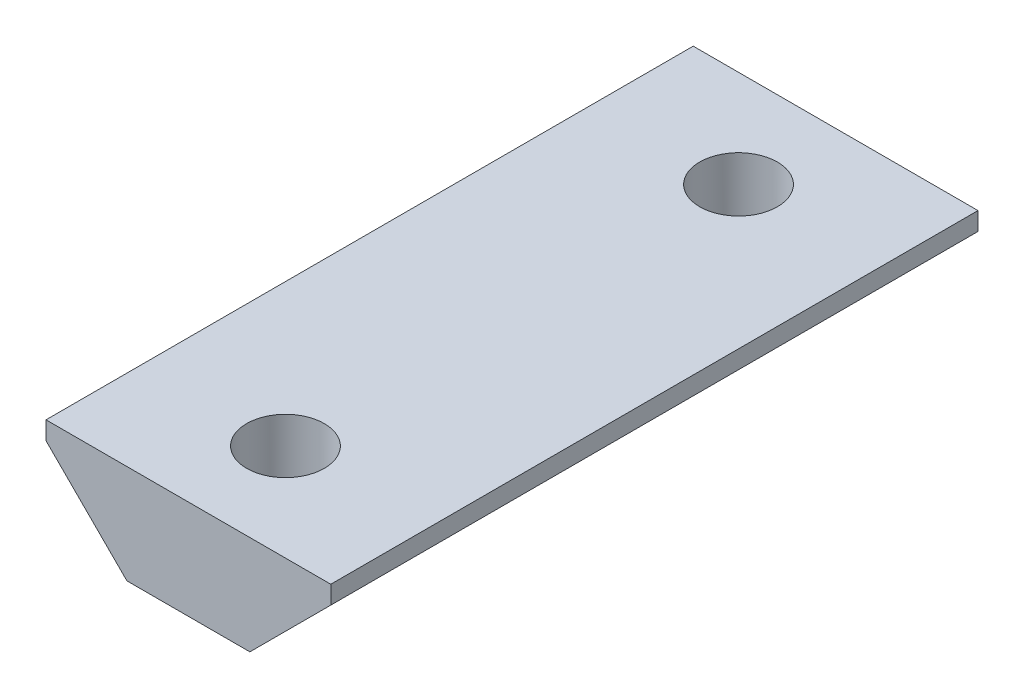
ISO-10303-21;
HEADER;
FILE_DESCRIPTION(('STEP AP214'),'2;1');
FILE_NAME('part.step','',(''),(''),'','','');
FILE_SCHEMA(('AUTOMOTIVE_DESIGN { 1 0 10303 214 1 1 1 1 }'));
ENDSEC;
DATA;
#1=APPLICATION_CONTEXT('core data for automotive mechanical design processes');
#2=APPLICATION_PROTOCOL_DEFINITION('international standard','automotive_design',2000,#1);
#3=PRODUCT_CONTEXT('',#1,'mechanical');
#4=PRODUCT('Part','Part','',(#3));
#5=PRODUCT_RELATED_PRODUCT_CATEGORY('part','',(#4));
#6=PRODUCT_DEFINITION_FORMATION('','',#4);
#7=PRODUCT_DEFINITION_CONTEXT('part definition',#1,'design');
#8=PRODUCT_DEFINITION('design','',#6,#7);
#9=PRODUCT_DEFINITION_SHAPE('','',#8);
#10=(LENGTH_UNIT() NAMED_UNIT(*) SI_UNIT(.MILLI.,.METRE.));
#11=(NAMED_UNIT(*) PLANE_ANGLE_UNIT() SI_UNIT($,.RADIAN.));
#12=(NAMED_UNIT(*) SI_UNIT($,.STERADIAN.) SOLID_ANGLE_UNIT());
#13=UNCERTAINTY_MEASURE_WITH_UNIT(LENGTH_MEASURE(1.E-05),#10,'distance_accuracy_value','');
#14=(GEOMETRIC_REPRESENTATION_CONTEXT(3) GLOBAL_UNCERTAINTY_ASSIGNED_CONTEXT((#13)) GLOBAL_UNIT_ASSIGNED_CONTEXT((#10,
#11,#12)) REPRESENTATION_CONTEXT('',''));
#15=CARTESIAN_POINT('',(0.,0.,0.));
#16=DIRECTION('',(0.,0.,1.));
#17=DIRECTION('',(1.,0.,0.));
#18=AXIS2_PLACEMENT_3D('',#15,#16,#17);
#19=CARTESIAN_POINT('',(-4.75000000000002,0.,25.));
#20=DIRECTION('',(0.707106781186549,0.707106781186546,0.));
#21=DIRECTION('',(-0.707106781186546,0.707106781186549,0.));
#22=AXIS2_PLACEMENT_3D('',#19,#20,#21);
#23=PLANE('',#22);
#24=DIRECTION('',(0.707106781186546,-0.707106781186549,0.));
#25=VECTOR('',#24,1.);
#26=CARTESIAN_POINT('',(-4.75000000000002,0.,-25.));
#27=LINE('',#26,#25);
#28=CARTESIAN_POINT('',(-11.,6.25,-25.));
#29=VERTEX_POINT('',#28);
#30=CARTESIAN_POINT('',(-4.75000000000002,0.,-25.));
#31=VERTEX_POINT('',#30);
#32=EDGE_CURVE('E119',#29,#31,#27,.T.);
#33=ORIENTED_EDGE('',*,*,#32,.T.);
#34=DIRECTION('',(0.,0.,-1.));
#35=VECTOR('',#34,1.);
#36=CARTESIAN_POINT('',(-4.75000000000002,0.,25.));
#37=LINE('',#36,#35);
#38=CARTESIAN_POINT('',(-4.75000000000002,0.,25.));
#39=VERTEX_POINT('',#38);
#40=EDGE_CURVE('E11',#39,#31,#37,.T.);
#41=ORIENTED_EDGE('',*,*,#40,.F.);
#42=DIRECTION('',(0.707106781186546,-0.707106781186549,0.));
#43=VECTOR('',#42,1.);
#44=CARTESIAN_POINT('',(-4.75000000000002,0.,25.));
#45=LINE('',#44,#43);
#46=CARTESIAN_POINT('',(-11.,6.25,25.));
#47=VERTEX_POINT('',#46);
#48=EDGE_CURVE('E130',#47,#39,#45,.T.);
#49=ORIENTED_EDGE('',*,*,#48,.F.);
#50=DIRECTION('',(0.,0.,-1.));
#51=VECTOR('',#50,1.);
#52=CARTESIAN_POINT('',(-11.,6.25,25.));
#53=LINE('',#52,#51);
#54=EDGE_CURVE('E115',#47,#29,#53,.T.);
#55=ORIENTED_EDGE('',*,*,#54,.T.);
#56=EDGE_LOOP('',(#33,#41,#49,#55));
#57=FACE_BOUND('',#56,.T.);
#58=ADVANCED_FACE('F33',(#57),#23,.F.);
#59=CARTESIAN_POINT('',(4.75000000000002,0.,25.));
#60=DIRECTION('',(0.,1.,0.));
#61=DIRECTION('',(0.,0.,1.));
#62=AXIS2_PLACEMENT_3D('',#59,#60,#61);
#63=PLANE('',#62);
#64=CARTESIAN_POINT('',(0.,0.,-17.5));
#65=DIRECTION('',(0.,1.,0.));
#66=DIRECTION('',(0.,0.,1.));
#67=AXIS2_PLACEMENT_3D('',#64,#65,#66);
#68=CIRCLE('',#67,3.);
#69=CARTESIAN_POINT('',(0.,0.,-14.5));
#70=VERTEX_POINT('',#69);
#71=EDGE_CURVE('E123',#70,#70,#68,.T.);
#72=ORIENTED_EDGE('',*,*,#71,.T.);
#73=EDGE_LOOP('',(#72));
#74=FACE_BOUND('',#73,.T.);
#75=CARTESIAN_POINT('',(0.,0.,17.5));
#76=DIRECTION('',(0.,1.,0.));
#77=DIRECTION('',(0.,0.,1.));
#78=AXIS2_PLACEMENT_3D('',#75,#76,#77);
#79=CIRCLE('',#78,3.);
#80=CARTESIAN_POINT('',(0.,0.,20.5));
#81=VERTEX_POINT('',#80);
#82=EDGE_CURVE('E137',#81,#81,#79,.T.);
#83=ORIENTED_EDGE('',*,*,#82,.T.);
#84=EDGE_LOOP('',(#83));
#85=FACE_BOUND('',#84,.T.);
#86=DIRECTION('',(1.,0.,0.));
#87=VECTOR('',#86,1.);
#88=CARTESIAN_POINT('',(4.75000000000002,0.,-25.));
#89=LINE('',#88,#87);
#90=CARTESIAN_POINT('',(4.75000000000002,0.,-25.));
#91=VERTEX_POINT('',#90);
#92=EDGE_CURVE('E122',#31,#91,#89,.T.);
#93=ORIENTED_EDGE('',*,*,#92,.T.);
#94=DIRECTION('',(0.,0.,-1.));
#95=VECTOR('',#94,1.);
#96=CARTESIAN_POINT('',(4.75000000000002,0.,25.));
#97=LINE('',#96,#95);
#98=CARTESIAN_POINT('',(4.75000000000002,0.,25.));
#99=VERTEX_POINT('',#98);
#100=EDGE_CURVE('E42',#99,#91,#97,.T.);
#101=ORIENTED_EDGE('',*,*,#100,.F.);
#102=DIRECTION('',(1.,0.,0.));
#103=VECTOR('',#102,1.);
#104=CARTESIAN_POINT('',(4.75000000000002,0.,25.));
#105=LINE('',#104,#103);
#106=EDGE_CURVE('E88',#39,#99,#105,.T.);
#107=ORIENTED_EDGE('',*,*,#106,.F.);
#108=ORIENTED_EDGE('',*,*,#40,.T.);
#109=EDGE_LOOP('',(#93,#101,#107,#108));
#110=FACE_BOUND('',#109,.T.);
#111=ADVANCED_FACE('F151',(#74,#85,#110),#63,.F.);
#112=CARTESIAN_POINT('',(4.75000000000002,0.,25.));
#113=DIRECTION('',(-0.707106781186549,0.707106781186546,0.));
#114=DIRECTION('',(-0.707106781186546,-0.707106781186549,0.));
#115=AXIS2_PLACEMENT_3D('',#112,#113,#114);
#116=PLANE('',#115);
#117=DIRECTION('',(0.707106781186546,0.707106781186549,0.));
#118=VECTOR('',#117,1.);
#119=CARTESIAN_POINT('',(4.75000000000002,0.,-25.));
#120=LINE('',#119,#118);
#121=CARTESIAN_POINT('',(11.,6.25,-25.));
#122=VERTEX_POINT('',#121);
#123=EDGE_CURVE('E125',#91,#122,#120,.T.);
#124=ORIENTED_EDGE('',*,*,#123,.T.);
#125=DIRECTION('',(0.,0.,-1.));
#126=VECTOR('',#125,1.);
#127=CARTESIAN_POINT('',(11.,6.25,25.));
#128=LINE('',#127,#126);
#129=CARTESIAN_POINT('',(11.,6.25,25.));
#130=VERTEX_POINT('',#129);
#131=EDGE_CURVE('E110',#130,#122,#128,.T.);
#132=ORIENTED_EDGE('',*,*,#131,.F.);
#133=DIRECTION('',(0.707106781186546,0.707106781186549,0.));
#134=VECTOR('',#133,1.);
#135=CARTESIAN_POINT('',(4.75000000000002,0.,25.));
#136=LINE('',#135,#134);
#137=EDGE_CURVE('E101',#99,#130,#136,.T.);
#138=ORIENTED_EDGE('',*,*,#137,.F.);
#139=ORIENTED_EDGE('',*,*,#100,.T.);
#140=EDGE_LOOP('',(#124,#132,#138,#139));
#141=FACE_BOUND('',#140,.T.);
#142=ADVANCED_FACE('F154',(#141),#116,.F.);
#143=CARTESIAN_POINT('',(11.,6.25,25.));
#144=DIRECTION('',(-1.,0.,0.));
#145=DIRECTION('',(0.,0.,1.));
#146=AXIS2_PLACEMENT_3D('',#143,#144,#145);
#147=PLANE('',#146);
#148=DIRECTION('',(0.,1.,0.));
#149=VECTOR('',#148,1.);
#150=CARTESIAN_POINT('',(11.,6.25,-25.));
#151=LINE('',#150,#149);
#152=CARTESIAN_POINT('',(11.,7.65,-25.));
#153=VERTEX_POINT('',#152);
#154=EDGE_CURVE('E109',#122,#153,#151,.T.);
#155=ORIENTED_EDGE('',*,*,#154,.T.);
#156=DIRECTION('',(0.,0.,-1.));
#157=VECTOR('',#156,1.);
#158=CARTESIAN_POINT('',(11.,7.65,25.));
#159=LINE('',#158,#157);
#160=CARTESIAN_POINT('',(11.,7.65,25.));
#161=VERTEX_POINT('',#160);
#162=EDGE_CURVE('E106',#161,#153,#159,.T.);
#163=ORIENTED_EDGE('',*,*,#162,.F.);
#164=DIRECTION('',(0.,1.,0.));
#165=VECTOR('',#164,1.);
#166=CARTESIAN_POINT('',(11.,6.25,25.));
#167=LINE('',#166,#165);
#168=EDGE_CURVE('E95',#130,#161,#167,.T.);
#169=ORIENTED_EDGE('',*,*,#168,.F.);
#170=ORIENTED_EDGE('',*,*,#131,.T.);
#171=EDGE_LOOP('',(#155,#163,#169,#170));
#172=FACE_BOUND('',#171,.T.);
#173=ADVANCED_FACE('F107',(#172),#147,.F.);
#174=CARTESIAN_POINT('',(-11.,7.65,25.));
#175=DIRECTION('',(0.,-1.,0.));
#176=DIRECTION('',(0.,0.,-1.));
#177=AXIS2_PLACEMENT_3D('',#174,#175,#176);
#178=PLANE('',#177);
#179=CARTESIAN_POINT('',(0.,7.65,-17.5));
#180=DIRECTION('',(0.,-1.,0.));
#181=DIRECTION('',(0.,0.,-1.));
#182=AXIS2_PLACEMENT_3D('',#179,#180,#181);
#183=CIRCLE('',#182,3.);
#184=CARTESIAN_POINT('',(0.,7.65,-20.5));
#185=VERTEX_POINT('',#184);
#186=EDGE_CURVE('E36',#185,#185,#183,.T.);
#187=ORIENTED_EDGE('',*,*,#186,.T.);
#188=EDGE_LOOP('',(#187));
#189=FACE_BOUND('',#188,.T.);
#190=CARTESIAN_POINT('',(0.,7.65,17.5));
#191=DIRECTION('',(0.,-1.,0.));
#192=DIRECTION('',(0.,0.,-1.));
#193=AXIS2_PLACEMENT_3D('',#190,#191,#192);
#194=CIRCLE('',#193,3.);
#195=CARTESIAN_POINT('',(0.,7.65,14.5));
#196=VERTEX_POINT('',#195);
#197=EDGE_CURVE('E135',#196,#196,#194,.T.);
#198=ORIENTED_EDGE('',*,*,#197,.T.);
#199=EDGE_LOOP('',(#198));
#200=FACE_BOUND('',#199,.T.);
#201=DIRECTION('',(-1.,0.,0.));
#202=VECTOR('',#201,1.);
#203=CARTESIAN_POINT('',(-11.,7.65,-25.));
#204=LINE('',#203,#202);
#205=CARTESIAN_POINT('',(-11.,7.65,-25.));
#206=VERTEX_POINT('',#205);
#207=EDGE_CURVE('E74',#153,#206,#204,.T.);
#208=ORIENTED_EDGE('',*,*,#207,.T.);
#209=DIRECTION('',(0.,0.,-1.));
#210=VECTOR('',#209,1.);
#211=CARTESIAN_POINT('',(-11.,7.65,25.));
#212=LINE('',#211,#210);
#213=CARTESIAN_POINT('',(-11.,7.65,25.));
#214=VERTEX_POINT('',#213);
#215=EDGE_CURVE('E111',#214,#206,#212,.T.);
#216=ORIENTED_EDGE('',*,*,#215,.F.);
#217=DIRECTION('',(-1.,0.,0.));
#218=VECTOR('',#217,1.);
#219=CARTESIAN_POINT('',(-11.,7.65,25.));
#220=LINE('',#219,#218);
#221=EDGE_CURVE('E99',#161,#214,#220,.T.);
#222=ORIENTED_EDGE('',*,*,#221,.F.);
#223=ORIENTED_EDGE('',*,*,#162,.T.);
#224=EDGE_LOOP('',(#208,#216,#222,#223));
#225=FACE_BOUND('',#224,.T.);
#226=ADVANCED_FACE('F113',(#189,#200,#225),#178,.F.);
#227=CARTESIAN_POINT('',(-11.,6.25,25.));
#228=DIRECTION('',(1.,0.,0.));
#229=DIRECTION('',(0.,0.,-1.));
#230=AXIS2_PLACEMENT_3D('',#227,#228,#229);
#231=PLANE('',#230);
#232=DIRECTION('',(0.,-1.,0.));
#233=VECTOR('',#232,1.);
#234=CARTESIAN_POINT('',(-11.,6.25,-25.));
#235=LINE('',#234,#233);
#236=EDGE_CURVE('E80',#206,#29,#235,.T.);
#237=ORIENTED_EDGE('',*,*,#236,.T.);
#238=ORIENTED_EDGE('',*,*,#54,.F.);
#239=DIRECTION('',(0.,-1.,0.));
#240=VECTOR('',#239,1.);
#241=CARTESIAN_POINT('',(-11.,6.25,25.));
#242=LINE('',#241,#240);
#243=EDGE_CURVE('E51',#214,#47,#242,.T.);
#244=ORIENTED_EDGE('',*,*,#243,.F.);
#245=ORIENTED_EDGE('',*,*,#215,.T.);
#246=EDGE_LOOP('',(#237,#238,#244,#245));
#247=FACE_BOUND('',#246,.T.);
#248=ADVANCED_FACE('F159',(#247),#231,.F.);
#249=CARTESIAN_POINT('',(0.,0.,25.));
#250=DIRECTION('',(0.,0.,-1.));
#251=DIRECTION('',(-1.,0.,0.));
#252=AXIS2_PLACEMENT_3D('',#249,#250,#251);
#253=PLANE('',#252);
#254=ORIENTED_EDGE('',*,*,#48,.T.);
#255=ORIENTED_EDGE('',*,*,#106,.T.);
#256=ORIENTED_EDGE('',*,*,#137,.T.);
#257=ORIENTED_EDGE('',*,*,#168,.T.);
#258=ORIENTED_EDGE('',*,*,#221,.T.);
#259=ORIENTED_EDGE('',*,*,#243,.T.);
#260=EDGE_LOOP('',(#254,#255,#256,#257,#258,#259));
#261=FACE_BOUND('',#260,.T.);
#262=ADVANCED_FACE('F97',(#261),#253,.F.);
#263=CARTESIAN_POINT('',(0.,0.,-25.));
#264=DIRECTION('',(0.,0.,-1.));
#265=DIRECTION('',(-1.,0.,0.));
#266=AXIS2_PLACEMENT_3D('',#263,#264,#265);
#267=PLANE('',#266);
#268=ORIENTED_EDGE('',*,*,#32,.F.);
#269=ORIENTED_EDGE('',*,*,#236,.F.);
#270=ORIENTED_EDGE('',*,*,#207,.F.);
#271=ORIENTED_EDGE('',*,*,#154,.F.);
#272=ORIENTED_EDGE('',*,*,#123,.F.);
#273=ORIENTED_EDGE('',*,*,#92,.F.);
#274=EDGE_LOOP('',(#268,#269,#270,#271,#272,#273));
#275=FACE_BOUND('',#274,.T.);
#276=ADVANCED_FACE('F157',(#275),#267,.T.);
#277=CARTESIAN_POINT('',(0.,-17.35,17.5));
#278=DIRECTION('',(0.,1.,0.));
#279=DIRECTION('',(0.,0.,1.));
#280=AXIS2_PLACEMENT_3D('',#277,#278,#279);
#281=CYLINDRICAL_SURFACE('',#280,3.);
#282=ORIENTED_EDGE('',*,*,#197,.F.);
#283=EDGE_LOOP('',(#282));
#284=FACE_BOUND('',#283,.T.);
#285=ORIENTED_EDGE('',*,*,#82,.F.);
#286=EDGE_LOOP('',(#285));
#287=FACE_BOUND('',#286,.T.);
#288=ADVANCED_FACE('F198',(#284,#287),#281,.F.);
#289=CARTESIAN_POINT('',(0.,-17.35,-17.5));
#290=DIRECTION('',(0.,1.,0.));
#291=DIRECTION('',(0.,0.,1.));
#292=AXIS2_PLACEMENT_3D('',#289,#290,#291);
#293=CYLINDRICAL_SURFACE('',#292,3.);
#294=ORIENTED_EDGE('',*,*,#186,.F.);
#295=EDGE_LOOP('',(#294));
#296=FACE_BOUND('',#295,.T.);
#297=ORIENTED_EDGE('',*,*,#71,.F.);
#298=EDGE_LOOP('',(#297));
#299=FACE_BOUND('',#298,.T.);
#300=ADVANCED_FACE('F203',(#296,#299),#293,.F.);
#301=CLOSED_SHELL('',(#58,#111,#142,#173,#226,#248,#262,#276,#288,#300));
#302=MANIFOLD_SOLID_BREP('B2',#301);
#303=ADVANCED_BREP_SHAPE_REPRESENTATION('',(#18,#302),#14);
#304=SHAPE_DEFINITION_REPRESENTATION(#9,#303);
ENDSEC;
END-ISO-10303-21;
